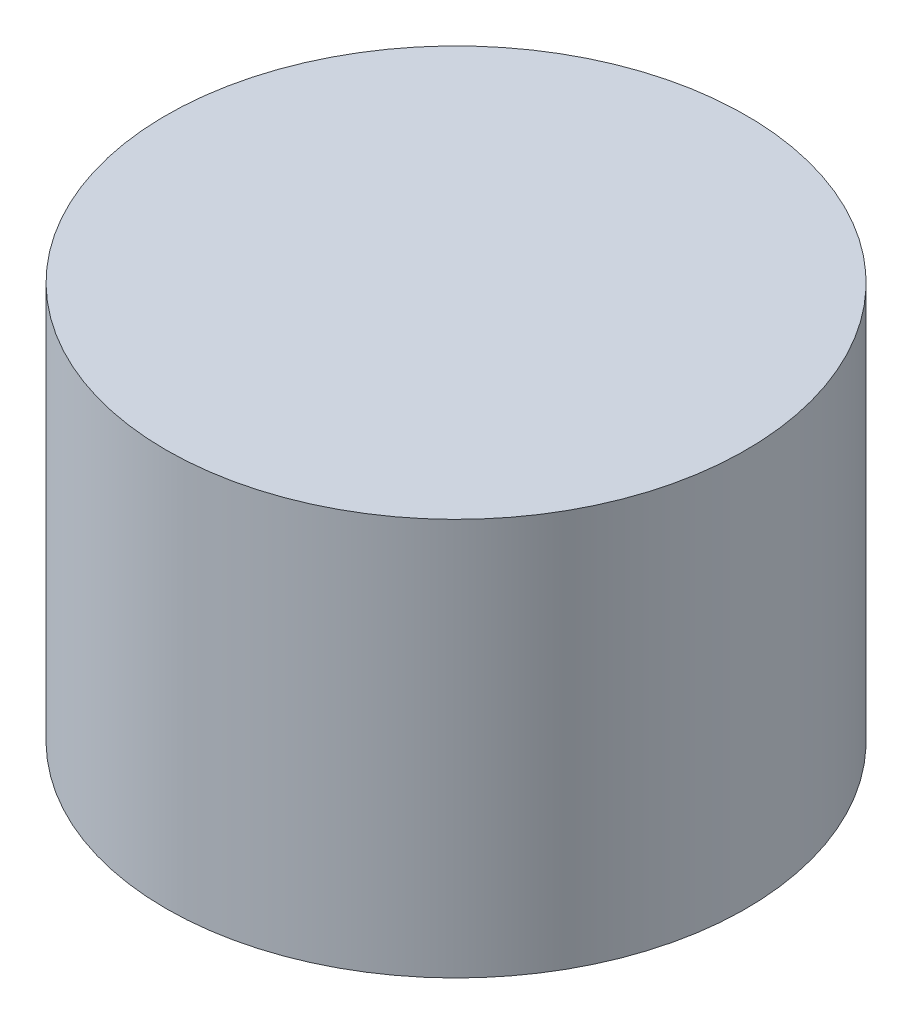
ISO-10303-21;
HEADER;
FILE_DESCRIPTION(('STEP AP214'),'2;1');
FILE_NAME('part.step','',(''),(''),'','','');
FILE_SCHEMA(('AUTOMOTIVE_DESIGN { 1 0 10303 214 1 1 1 1 }'));
ENDSEC;
DATA;
#1=APPLICATION_CONTEXT('core data for automotive mechanical design processes');
#2=APPLICATION_PROTOCOL_DEFINITION('international standard','automotive_design',2000,#1);
#3=PRODUCT_CONTEXT('',#1,'mechanical');
#4=PRODUCT('Part','Part','',(#3));
#5=PRODUCT_RELATED_PRODUCT_CATEGORY('part','',(#4));
#6=PRODUCT_DEFINITION_FORMATION('','',#4);
#7=PRODUCT_DEFINITION_CONTEXT('part definition',#1,'design');
#8=PRODUCT_DEFINITION('design','',#6,#7);
#9=PRODUCT_DEFINITION_SHAPE('','',#8);
#10=(LENGTH_UNIT() NAMED_UNIT(*) SI_UNIT(.MILLI.,.METRE.));
#11=(NAMED_UNIT(*) PLANE_ANGLE_UNIT() SI_UNIT($,.RADIAN.));
#12=(NAMED_UNIT(*) SI_UNIT($,.STERADIAN.) SOLID_ANGLE_UNIT());
#13=UNCERTAINTY_MEASURE_WITH_UNIT(LENGTH_MEASURE(1.E-05),#10,'distance_accuracy_value','');
#14=(GEOMETRIC_REPRESENTATION_CONTEXT(3) GLOBAL_UNCERTAINTY_ASSIGNED_CONTEXT((#13)) GLOBAL_UNIT_ASSIGNED_CONTEXT((#10,
#11,#12)) REPRESENTATION_CONTEXT('',''));
#15=CARTESIAN_POINT('',(0.,0.,0.));
#16=DIRECTION('',(0.,0.,1.));
#17=DIRECTION('',(1.,0.,0.));
#18=AXIS2_PLACEMENT_3D('',#15,#16,#17);
#19=CARTESIAN_POINT('',(0.,0.5,0.));
#20=DIRECTION('',(0.,-1.,0.));
#21=DIRECTION('',(0.,0.,-1.));
#22=AXIS2_PLACEMENT_3D('',#19,#20,#21);
#23=CYLINDRICAL_SURFACE('',#22,0.365);
#24=CARTESIAN_POINT('',(0.,0.5,0.));
#25=DIRECTION('',(0.,1.,0.));
#26=DIRECTION('',(0.,0.,1.));
#27=AXIS2_PLACEMENT_3D('',#24,#25,#26);
#28=CIRCLE('',#27,0.365);
#29=CARTESIAN_POINT('',(0.,0.5,0.365));
#30=VERTEX_POINT('',#29);
#31=EDGE_CURVE('E12',#30,#30,#28,.T.);
#32=ORIENTED_EDGE('',*,*,#31,.F.);
#33=EDGE_LOOP('',(#32));
#34=FACE_BOUND('',#33,.T.);
#35=CARTESIAN_POINT('',(0.,0.,0.));
#36=DIRECTION('',(0.,1.,0.));
#37=DIRECTION('',(0.,0.,1.));
#38=AXIS2_PLACEMENT_3D('',#35,#36,#37);
#39=CIRCLE('',#38,0.365);
#40=CARTESIAN_POINT('',(0.,0.,0.365));
#41=VERTEX_POINT('',#40);
#42=EDGE_CURVE('E43',#41,#41,#39,.T.);
#43=ORIENTED_EDGE('',*,*,#42,.T.);
#44=EDGE_LOOP('',(#43));
#45=FACE_BOUND('',#44,.T.);
#46=ADVANCED_FACE('F40',(#34,#45),#23,.T.);
#47=CARTESIAN_POINT('',(0.,0.5,0.));
#48=DIRECTION('',(0.,1.,0.));
#49=DIRECTION('',(0.,0.,1.));
#50=AXIS2_PLACEMENT_3D('',#47,#48,#49);
#51=PLANE('',#50);
#52=ORIENTED_EDGE('',*,*,#31,.T.);
#53=EDGE_LOOP('',(#52));
#54=FACE_BOUND('',#53,.T.);
#55=ADVANCED_FACE('F55',(#54),#51,.T.);
#56=CARTESIAN_POINT('',(0.,0.,0.));
#57=DIRECTION('',(0.,1.,0.));
#58=DIRECTION('',(0.,0.,1.));
#59=AXIS2_PLACEMENT_3D('',#56,#57,#58);
#60=PLANE('',#59);
#61=ORIENTED_EDGE('',*,*,#42,.F.);
#62=EDGE_LOOP('',(#61));
#63=FACE_BOUND('',#62,.T.);
#64=ADVANCED_FACE('F53',(#63),#60,.F.);
#65=CLOSED_SHELL('',(#46,#55,#64));
#66=MANIFOLD_SOLID_BREP('B2',#65);
#67=ADVANCED_BREP_SHAPE_REPRESENTATION('',(#18,#66),#14);
#68=SHAPE_DEFINITION_REPRESENTATION(#9,#67);
ENDSEC;
END-ISO-10303-21;
